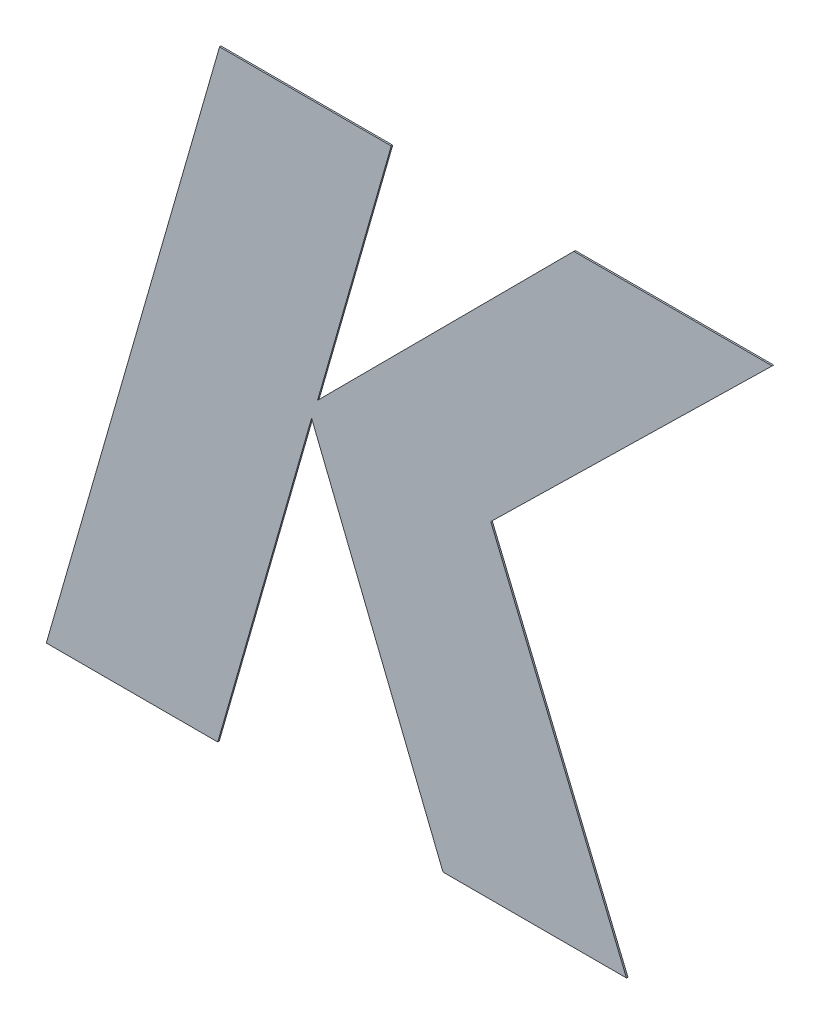
ISO-10303-21;
HEADER;
FILE_DESCRIPTION(('STEP AP214'),'2;1');
FILE_NAME('part.step','',(''),(''),'','','');
FILE_SCHEMA(('AUTOMOTIVE_DESIGN { 1 0 10303 214 1 1 1 1 }'));
ENDSEC;
DATA;
#1=APPLICATION_CONTEXT('core data for automotive mechanical design processes');
#2=APPLICATION_PROTOCOL_DEFINITION('international standard','automotive_design',2000,#1);
#3=PRODUCT_CONTEXT('',#1,'mechanical');
#4=PRODUCT('Part','Part','',(#3));
#5=PRODUCT_RELATED_PRODUCT_CATEGORY('part','',(#4));
#6=PRODUCT_DEFINITION_FORMATION('','',#4);
#7=PRODUCT_DEFINITION_CONTEXT('part definition',#1,'design');
#8=PRODUCT_DEFINITION('design','',#6,#7);
#9=PRODUCT_DEFINITION_SHAPE('','',#8);
#10=(LENGTH_UNIT() NAMED_UNIT(*) SI_UNIT(.MILLI.,.METRE.));
#11=(NAMED_UNIT(*) PLANE_ANGLE_UNIT() SI_UNIT($,.RADIAN.));
#12=(NAMED_UNIT(*) SI_UNIT($,.STERADIAN.) SOLID_ANGLE_UNIT());
#13=UNCERTAINTY_MEASURE_WITH_UNIT(LENGTH_MEASURE(1.E-05),#10,'distance_accuracy_value','');
#14=(GEOMETRIC_REPRESENTATION_CONTEXT(3) GLOBAL_UNCERTAINTY_ASSIGNED_CONTEXT((#13)) GLOBAL_UNIT_ASSIGNED_CONTEXT((#10,
#11,#12)) REPRESENTATION_CONTEXT('',''));
#15=CARTESIAN_POINT('',(0.,0.,0.));
#16=DIRECTION('',(0.,0.,1.));
#17=DIRECTION('',(1.,0.,0.));
#18=AXIS2_PLACEMENT_3D('',#15,#16,#17);
#19=CARTESIAN_POINT('',(3.91803,4.77633,5.205));
#20=DIRECTION('',(0.961099233431586,-0.276203301025201,0.));
#21=DIRECTION('',(0.,0.,-1.));
#22=AXIS2_PLACEMENT_3D('',#19,#20,#21);
#23=PLANE('',#22);
#24=DIRECTION('',(-0.276203301025201,-0.961099233431586,0.));
#25=VECTOR('',#24,1.);
#26=CARTESIAN_POINT('',(3.91803,4.77633,5.2));
#27=LINE('',#26,#25);
#28=CARTESIAN_POINT('',(4.5070939744564,6.82608440985244,5.2));
#29=VERTEX_POINT('',#28);
#30=CARTESIAN_POINT('',(3.91803,4.77633,5.2));
#31=VERTEX_POINT('',#30);
#32=EDGE_CURVE('E11',#29,#31,#27,.T.);
#33=ORIENTED_EDGE('',*,*,#32,.T.);
#34=DIRECTION('',(0.,0.,-1.));
#35=VECTOR('',#34,1.);
#36=CARTESIAN_POINT('',(3.91803,4.77633,5.205));
#37=LINE('',#36,#35);
#38=CARTESIAN_POINT('',(3.91803,4.77633,5.205));
#39=VERTEX_POINT('',#38);
#40=EDGE_CURVE('E43',#39,#31,#37,.T.);
#41=ORIENTED_EDGE('',*,*,#40,.F.);
#42=DIRECTION('',(-0.276203301025201,-0.961099233431586,0.));
#43=VECTOR('',#42,1.);
#44=CARTESIAN_POINT('',(3.91803,4.77633,5.205));
#45=LINE('',#44,#43);
#46=CARTESIAN_POINT('',(4.5070939744564,6.82608440985244,5.205));
#47=VERTEX_POINT('',#46);
#48=EDGE_CURVE('E184',#47,#39,#45,.T.);
#49=ORIENTED_EDGE('',*,*,#48,.F.);
#50=DIRECTION('',(0.,0.,-1.));
#51=VECTOR('',#50,1.);
#52=CARTESIAN_POINT('',(4.5070939744564,6.82608440985244,5.205));
#53=LINE('',#52,#51);
#54=EDGE_CURVE('E28',#47,#29,#53,.T.);
#55=ORIENTED_EDGE('',*,*,#54,.T.);
#56=EDGE_LOOP('',(#33,#41,#49,#55));
#57=FACE_BOUND('',#56,.T.);
#58=ADVANCED_FACE('F17',(#57),#23,.F.);
#59=CARTESIAN_POINT('',(4.50088641085166,4.77632999999994,5.205));
#60=DIRECTION('',(0.,1.,0.));
#61=DIRECTION('',(1.,0.,-1.10443527591038E-13));
#62=AXIS2_PLACEMENT_3D('',#59,#60,#61);
#63=PLANE('',#62);
#64=DIRECTION('',(1.,-1.10443527591038E-13,0.));
#65=VECTOR('',#64,1.);
#66=CARTESIAN_POINT('',(4.50088641085166,4.77632999999994,5.2));
#67=LINE('',#66,#65);
#68=CARTESIAN_POINT('',(4.50088641085166,4.77632999999994,5.2));
#69=VERTEX_POINT('',#68);
#70=EDGE_CURVE('E191',#31,#69,#67,.T.);
#71=ORIENTED_EDGE('',*,*,#70,.T.);
#72=DIRECTION('',(0.,0.,-1.));
#73=VECTOR('',#72,1.);
#74=CARTESIAN_POINT('',(4.50088641085166,4.77632999999994,5.205));
#75=LINE('',#74,#73);
#76=CARTESIAN_POINT('',(4.50088641085166,4.77632999999994,5.205));
#77=VERTEX_POINT('',#76);
#78=EDGE_CURVE('E200',#77,#69,#75,.T.);
#79=ORIENTED_EDGE('',*,*,#78,.F.);
#80=DIRECTION('',(1.,-1.10443527591038E-13,0.));
#81=VECTOR('',#80,1.);
#82=CARTESIAN_POINT('',(4.50088641085166,4.77632999999994,5.205));
#83=LINE('',#82,#81);
#84=EDGE_CURVE('E188',#39,#77,#83,.T.);
#85=ORIENTED_EDGE('',*,*,#84,.F.);
#86=ORIENTED_EDGE('',*,*,#40,.T.);
#87=EDGE_LOOP('',(#71,#79,#85,#86));
#88=FACE_BOUND('',#87,.T.);
#89=ADVANCED_FACE('F403',(#88),#63,.F.);
#90=CARTESIAN_POINT('',(4.81988404513849,5.88929101332706,5.205));
#91=DIRECTION('',(-0.961293454474758,0.275526576547503,0.));
#92=DIRECTION('',(0.,0.,1.));
#93=AXIS2_PLACEMENT_3D('',#90,#91,#92);
#94=PLANE('',#93);
#95=DIRECTION('',(0.275526576547503,0.961293454474758,0.));
#96=VECTOR('',#95,1.);
#97=CARTESIAN_POINT('',(4.81988404513849,5.88929101332706,5.2));
#98=LINE('',#97,#96);
#99=CARTESIAN_POINT('',(4.81988404513849,5.88929101332706,5.2));
#100=VERTEX_POINT('',#99);
#101=EDGE_CURVE('E226',#69,#100,#98,.T.);
#102=ORIENTED_EDGE('',*,*,#101,.T.);
#103=DIRECTION('',(0.,0.,-1.));
#104=VECTOR('',#103,1.);
#105=CARTESIAN_POINT('',(4.81988404513849,5.88929101332706,5.205));
#106=LINE('',#105,#104);
#107=CARTESIAN_POINT('',(4.81988404513849,5.88929101332706,5.205));
#108=VERTEX_POINT('',#107);
#109=EDGE_CURVE('E170',#108,#100,#106,.T.);
#110=ORIENTED_EDGE('',*,*,#109,.F.);
#111=DIRECTION('',(0.275526576547503,0.961293454474758,0.));
#112=VECTOR('',#111,1.);
#113=CARTESIAN_POINT('',(4.81988404513849,5.88929101332706,5.205));
#114=LINE('',#113,#112);
#115=EDGE_CURVE('E241',#77,#108,#114,.T.);
#116=ORIENTED_EDGE('',*,*,#115,.F.);
#117=ORIENTED_EDGE('',*,*,#78,.T.);
#118=EDGE_LOOP('',(#102,#110,#116,#117));
#119=FACE_BOUND('',#118,.T.);
#120=ADVANCED_FACE('F394',(#119),#94,.F.);
#121=CARTESIAN_POINT('',(5.26662283395568,4.77632999999994,5.205));
#122=DIRECTION('',(0.928029086213704,0.372507738364397,0.));
#123=DIRECTION('',(0.,0.,-1.));
#124=AXIS2_PLACEMENT_3D('',#121,#122,#123);
#125=PLANE('',#124);
#126=DIRECTION('',(0.372507738364397,-0.928029086213704,0.));
#127=VECTOR('',#126,1.);
#128=CARTESIAN_POINT('',(5.26662283395568,4.77632999999994,5.2));
#129=LINE('',#128,#127);
#130=CARTESIAN_POINT('',(5.26662283395568,4.77632999999994,5.2));
#131=VERTEX_POINT('',#130);
#132=EDGE_CURVE('E173',#100,#131,#129,.T.);
#133=ORIENTED_EDGE('',*,*,#132,.T.);
#134=DIRECTION('',(0.,0.,-1.));
#135=VECTOR('',#134,1.);
#136=CARTESIAN_POINT('',(5.26662283395568,4.77632999999994,5.205));
#137=LINE('',#136,#135);
#138=CARTESIAN_POINT('',(5.26662283395568,4.77632999999994,5.205));
#139=VERTEX_POINT('',#138);
#140=EDGE_CURVE('E201',#139,#131,#137,.T.);
#141=ORIENTED_EDGE('',*,*,#140,.F.);
#142=DIRECTION('',(0.372507738364397,-0.928029086213704,0.));
#143=VECTOR('',#142,1.);
#144=CARTESIAN_POINT('',(5.26662283395568,4.77632999999994,5.205));
#145=LINE('',#144,#143);
#146=EDGE_CURVE('E169',#108,#139,#145,.T.);
#147=ORIENTED_EDGE('',*,*,#146,.F.);
#148=ORIENTED_EDGE('',*,*,#109,.T.);
#149=EDGE_LOOP('',(#133,#141,#147,#148));
#150=FACE_BOUND('',#149,.T.);
#151=ADVANCED_FACE('F334',(#150),#125,.F.);
#152=CARTESIAN_POINT('',(5.89029583608144,4.77632999999994,5.205));
#153=DIRECTION('',(0.,1.,0.));
#154=DIRECTION('',(1.,0.,0.));
#155=AXIS2_PLACEMENT_3D('',#152,#153,#154);
#156=PLANE('',#155);
#157=DIRECTION('',(1.,0.,0.));
#158=VECTOR('',#157,1.);
#159=CARTESIAN_POINT('',(5.89029583608144,4.77632999999994,5.2));
#160=LINE('',#159,#158);
#161=CARTESIAN_POINT('',(5.89029583608144,4.77632999999994,5.2));
#162=VERTEX_POINT('',#161);
#163=EDGE_CURVE('E174',#131,#162,#160,.T.);
#164=ORIENTED_EDGE('',*,*,#163,.T.);
#165=DIRECTION('',(0.,0.,-1.));
#166=VECTOR('',#165,1.);
#167=CARTESIAN_POINT('',(5.89029583608144,4.77632999999994,5.205));
#168=LINE('',#167,#166);
#169=CARTESIAN_POINT('',(5.89029583608144,4.77632999999994,5.205));
#170=VERTEX_POINT('',#169);
#171=EDGE_CURVE('E179',#170,#162,#168,.T.);
#172=ORIENTED_EDGE('',*,*,#171,.F.);
#173=DIRECTION('',(1.,0.,0.));
#174=VECTOR('',#173,1.);
#175=CARTESIAN_POINT('',(5.89029583608144,4.77632999999994,5.205));
#176=LINE('',#175,#174);
#177=EDGE_CURVE('E166',#139,#170,#176,.T.);
#178=ORIENTED_EDGE('',*,*,#177,.F.);
#179=ORIENTED_EDGE('',*,*,#140,.T.);
#180=EDGE_LOOP('',(#164,#172,#178,#179));
#181=FACE_BOUND('',#180,.T.);
#182=ADVANCED_FACE('F329',(#181),#156,.F.);
#183=CARTESIAN_POINT('',(5.42896678366348,5.88929101332707,5.205));
#184=DIRECTION('',(-0.923783981403877,-0.382914031737676,0.));
#185=DIRECTION('',(-0.382914031737676,0.923783981403877,0.));
#186=AXIS2_PLACEMENT_3D('',#183,#184,#185);
#187=PLANE('',#186);
#188=DIRECTION('',(-0.382914031737676,0.923783981403877,0.));
#189=VECTOR('',#188,1.);
#190=CARTESIAN_POINT('',(5.42896678366348,5.88929101332707,5.2));
#191=LINE('',#190,#189);
#192=CARTESIAN_POINT('',(5.42896678366348,5.88929101332707,5.2));
#193=VERTEX_POINT('',#192);
#194=EDGE_CURVE('E203',#162,#193,#191,.T.);
#195=ORIENTED_EDGE('',*,*,#194,.T.);
#196=DIRECTION('',(0.,0.,-1.));
#197=VECTOR('',#196,1.);
#198=CARTESIAN_POINT('',(5.42896678366348,5.88929101332707,5.205));
#199=LINE('',#198,#197);
#200=CARTESIAN_POINT('',(5.42896678366348,5.88929101332707,5.205));
#201=VERTEX_POINT('',#200);
#202=EDGE_CURVE('E21',#201,#193,#199,.T.);
#203=ORIENTED_EDGE('',*,*,#202,.F.);
#204=DIRECTION('',(-0.382914031737676,0.923783981403877,0.));
#205=VECTOR('',#204,1.);
#206=CARTESIAN_POINT('',(5.42896678366348,5.88929101332707,5.205));
#207=LINE('',#206,#205);
#208=EDGE_CURVE('E134',#170,#201,#207,.T.);
#209=ORIENTED_EDGE('',*,*,#208,.F.);
#210=ORIENTED_EDGE('',*,*,#171,.T.);
#211=EDGE_LOOP('',(#195,#203,#209,#210));
#212=FACE_BOUND('',#211,.T.);
#213=ADVANCED_FACE('F333',(#212),#187,.F.);
#214=CARTESIAN_POINT('',(6.38585373580663,6.82608440985244,5.205));
#215=DIRECTION('',(-0.699564397226959,0.714569558638263,0.));
#216=DIRECTION('',(0.,0.,1.));
#217=AXIS2_PLACEMENT_3D('',#214,#215,#216);
#218=PLANE('',#217);
#219=DIRECTION('',(0.714569558638263,0.699564397226959,0.));
#220=VECTOR('',#219,1.);
#221=CARTESIAN_POINT('',(6.38585373580663,6.82608440985244,5.2));
#222=LINE('',#221,#220);
#223=CARTESIAN_POINT('',(6.38585373580663,6.82608440985244,5.2));
#224=VERTEX_POINT('',#223);
#225=EDGE_CURVE('E142',#193,#224,#222,.T.);
#226=ORIENTED_EDGE('',*,*,#225,.T.);
#227=DIRECTION('',(0.,0.,-1.));
#228=VECTOR('',#227,1.);
#229=CARTESIAN_POINT('',(6.38585373580663,6.82608440985244,5.205));
#230=LINE('',#229,#228);
#231=CARTESIAN_POINT('',(6.38585373580663,6.82608440985244,5.205));
#232=VERTEX_POINT('',#231);
#233=EDGE_CURVE('E140',#232,#224,#230,.T.);
#234=ORIENTED_EDGE('',*,*,#233,.F.);
#235=DIRECTION('',(0.714569558638263,0.699564397226959,0.));
#236=VECTOR('',#235,1.);
#237=CARTESIAN_POINT('',(6.38585373580663,6.82608440985244,5.205));
#238=LINE('',#237,#236);
#239=EDGE_CURVE('E126',#201,#232,#238,.T.);
#240=ORIENTED_EDGE('',*,*,#239,.F.);
#241=ORIENTED_EDGE('',*,*,#202,.T.);
#242=EDGE_LOOP('',(#226,#234,#240,#241));
#243=FACE_BOUND('',#242,.T.);
#244=ADVANCED_FACE('F19',(#243),#218,.F.);
#245=CARTESIAN_POINT('',(5.71129866959105,6.82608440985244,5.205));
#246=DIRECTION('',(0.,-1.,0.));
#247=DIRECTION('',(0.,0.,-1.));
#248=AXIS2_PLACEMENT_3D('',#245,#246,#247);
#249=PLANE('',#248);
#250=DIRECTION('',(-1.,0.,0.));
#251=VECTOR('',#250,1.);
#252=CARTESIAN_POINT('',(5.71129866959105,6.82608440985244,5.2));
#253=LINE('',#252,#251);
#254=CARTESIAN_POINT('',(5.71129866959105,6.82608440985244,5.2));
#255=VERTEX_POINT('',#254);
#256=EDGE_CURVE('E147',#224,#255,#253,.T.);
#257=ORIENTED_EDGE('',*,*,#256,.T.);
#258=DIRECTION('',(0.,0.,-1.));
#259=VECTOR('',#258,1.);
#260=CARTESIAN_POINT('',(5.71129866959105,6.82608440985244,5.205));
#261=LINE('',#260,#259);
#262=CARTESIAN_POINT('',(5.71129866959105,6.82608440985244,5.205));
#263=VERTEX_POINT('',#262);
#264=EDGE_CURVE('E151',#263,#255,#261,.T.);
#265=ORIENTED_EDGE('',*,*,#264,.F.);
#266=DIRECTION('',(-1.,0.,0.));
#267=VECTOR('',#266,1.);
#268=CARTESIAN_POINT('',(5.71129866959105,6.82608440985244,5.205));
#269=LINE('',#268,#267);
#270=EDGE_CURVE('E131',#232,#263,#269,.T.);
#271=ORIENTED_EDGE('',*,*,#270,.F.);
#272=ORIENTED_EDGE('',*,*,#233,.T.);
#273=EDGE_LOOP('',(#257,#265,#271,#272));
#274=FACE_BOUND('',#273,.T.);
#275=ADVANCED_FACE('F150',(#274),#249,.F.);
#276=CARTESIAN_POINT('',(4.84017080800069,5.95198988211872,5.205));
#277=DIRECTION('',(0.708307753494397,-0.70590376563645,0.));
#278=DIRECTION('',(0.,0.,-1.));
#279=AXIS2_PLACEMENT_3D('',#276,#277,#278);
#280=PLANE('',#279);
#281=DIRECTION('',(-0.70590376563645,-0.708307753494397,0.));
#282=VECTOR('',#281,1.);
#283=CARTESIAN_POINT('',(4.84017080800069,5.95198988211872,5.2));
#284=LINE('',#283,#282);
#285=CARTESIAN_POINT('',(4.84017080800069,5.95198988211872,5.2));
#286=VERTEX_POINT('',#285);
#287=EDGE_CURVE('E148',#255,#286,#284,.T.);
#288=ORIENTED_EDGE('',*,*,#287,.T.);
#289=DIRECTION('',(0.,0.,-1.));
#290=VECTOR('',#289,1.);
#291=CARTESIAN_POINT('',(4.84017080800069,5.95198988211872,5.205));
#292=LINE('',#291,#290);
#293=CARTESIAN_POINT('',(4.84017080800069,5.95198988211872,5.205));
#294=VERTEX_POINT('',#293);
#295=EDGE_CURVE('E196',#294,#286,#292,.T.);
#296=ORIENTED_EDGE('',*,*,#295,.F.);
#297=DIRECTION('',(-0.70590376563645,-0.708307753494397,0.));
#298=VECTOR('',#297,1.);
#299=CARTESIAN_POINT('',(4.84017080800069,5.95198988211872,5.205));
#300=LINE('',#299,#298);
#301=EDGE_CURVE('E154',#263,#294,#300,.T.);
#302=ORIENTED_EDGE('',*,*,#301,.F.);
#303=ORIENTED_EDGE('',*,*,#264,.T.);
#304=EDGE_LOOP('',(#288,#296,#302,#303));
#305=FACE_BOUND('',#304,.T.);
#306=ADVANCED_FACE('F340',(#305),#280,.F.);
#307=CARTESIAN_POINT('',(5.09072944844473,6.82608440985244,5.205));
#308=DIRECTION('',(-0.961286149092731,0.27555206325206,0.));
#309=DIRECTION('',(0.,0.,1.));
#310=AXIS2_PLACEMENT_3D('',#307,#308,#309);
#311=PLANE('',#310);
#312=DIRECTION('',(0.27555206325206,0.961286149092731,0.));
#313=VECTOR('',#312,1.);
#314=CARTESIAN_POINT('',(5.09072944844473,6.82608440985244,5.2));
#315=LINE('',#314,#313);
#316=CARTESIAN_POINT('',(5.09072944844473,6.82608440985244,5.2));
#317=VERTEX_POINT('',#316);
#318=EDGE_CURVE('E209',#286,#317,#315,.T.);
#319=ORIENTED_EDGE('',*,*,#318,.T.);
#320=DIRECTION('',(0.,0.,-1.));
#321=VECTOR('',#320,1.);
#322=CARTESIAN_POINT('',(5.09072944844473,6.82608440985244,5.205));
#323=LINE('',#322,#321);
#324=CARTESIAN_POINT('',(5.09072944844473,6.82608440985244,5.205));
#325=VERTEX_POINT('',#324);
#326=EDGE_CURVE('E187',#325,#317,#323,.T.);
#327=ORIENTED_EDGE('',*,*,#326,.F.);
#328=DIRECTION('',(0.27555206325206,0.961286149092731,0.));
#329=VECTOR('',#328,1.);
#330=CARTESIAN_POINT('',(5.09072944844473,6.82608440985244,5.205));
#331=LINE('',#330,#329);
#332=EDGE_CURVE('E160',#294,#325,#331,.T.);
#333=ORIENTED_EDGE('',*,*,#332,.F.);
#334=ORIENTED_EDGE('',*,*,#295,.T.);
#335=EDGE_LOOP('',(#319,#327,#333,#334));
#336=FACE_BOUND('',#335,.T.);
#337=ADVANCED_FACE('F344',(#336),#311,.F.);
#338=CARTESIAN_POINT('',(4.5070939744564,6.82608440985244,5.205));
#339=DIRECTION('',(0.,-1.,0.));
#340=DIRECTION('',(0.,0.,-1.));
#341=AXIS2_PLACEMENT_3D('',#338,#339,#340);
#342=PLANE('',#341);
#343=DIRECTION('',(-1.,0.,0.));
#344=VECTOR('',#343,1.);
#345=CARTESIAN_POINT('',(4.5070939744564,6.82608440985244,5.2));
#346=LINE('',#345,#344);
#347=EDGE_CURVE('E192',#317,#29,#346,.T.);
#348=ORIENTED_EDGE('',*,*,#347,.T.);
#349=ORIENTED_EDGE('',*,*,#54,.F.);
#350=DIRECTION('',(-1.,0.,0.));
#351=VECTOR('',#350,1.);
#352=CARTESIAN_POINT('',(4.5070939744564,6.82608440985244,5.205));
#353=LINE('',#352,#351);
#354=EDGE_CURVE('E180',#325,#47,#353,.T.);
#355=ORIENTED_EDGE('',*,*,#354,.F.);
#356=ORIENTED_EDGE('',*,*,#326,.T.);
#357=EDGE_LOOP('',(#348,#349,#355,#356));
#358=FACE_BOUND('',#357,.T.);
#359=ADVANCED_FACE('F353',(#358),#342,.F.);
#360=CARTESIAN_POINT('',(-0.222484440430861,-1.85805867567166,5.205));
#361=DIRECTION('',(0.,0.,-1.));
#362=DIRECTION('',(0.,-1.,0.));
#363=AXIS2_PLACEMENT_3D('',#360,#361,#362);
#364=PLANE('',#363);
#365=ORIENTED_EDGE('',*,*,#48,.T.);
#366=ORIENTED_EDGE('',*,*,#84,.T.);
#367=ORIENTED_EDGE('',*,*,#115,.T.);
#368=ORIENTED_EDGE('',*,*,#146,.T.);
#369=ORIENTED_EDGE('',*,*,#177,.T.);
#370=ORIENTED_EDGE('',*,*,#208,.T.);
#371=ORIENTED_EDGE('',*,*,#239,.T.);
#372=ORIENTED_EDGE('',*,*,#270,.T.);
#373=ORIENTED_EDGE('',*,*,#301,.T.);
#374=ORIENTED_EDGE('',*,*,#332,.T.);
#375=ORIENTED_EDGE('',*,*,#354,.T.);
#376=EDGE_LOOP('',(#365,#366,#367,#368,#369,#370,#371,#372,#373,#374,#375));
#377=FACE_BOUND('',#376,.T.);
#378=ADVANCED_FACE('F128',(#377),#364,.F.);
#379=CARTESIAN_POINT('',(-0.222484440430861,-1.85805867567166,5.2));
#380=DIRECTION('',(0.,0.,-1.));
#381=DIRECTION('',(0.,-1.,0.));
#382=AXIS2_PLACEMENT_3D('',#379,#380,#381);
#383=PLANE('',#382);
#384=ORIENTED_EDGE('',*,*,#32,.F.);
#385=ORIENTED_EDGE('',*,*,#347,.F.);
#386=ORIENTED_EDGE('',*,*,#318,.F.);
#387=ORIENTED_EDGE('',*,*,#287,.F.);
#388=ORIENTED_EDGE('',*,*,#256,.F.);
#389=ORIENTED_EDGE('',*,*,#225,.F.);
#390=ORIENTED_EDGE('',*,*,#194,.F.);
#391=ORIENTED_EDGE('',*,*,#163,.F.);
#392=ORIENTED_EDGE('',*,*,#132,.F.);
#393=ORIENTED_EDGE('',*,*,#101,.F.);
#394=ORIENTED_EDGE('',*,*,#70,.F.);
#395=EDGE_LOOP('',(#384,#385,#386,#387,#388,#389,#390,#391,#392,#393,#394));
#396=FACE_BOUND('',#395,.T.);
#397=ADVANCED_FACE('F359',(#396),#383,.T.);
#398=CLOSED_SHELL('',(#58,#89,#120,#151,#182,#213,#244,#275,#306,#337,#359,#378,#397));
#399=MANIFOLD_SOLID_BREP('B1',#398);
#400=ADVANCED_BREP_SHAPE_REPRESENTATION('',(#18,#399),#14);
#401=SHAPE_DEFINITION_REPRESENTATION(#9,#400);
ENDSEC;
END-ISO-10303-21;
